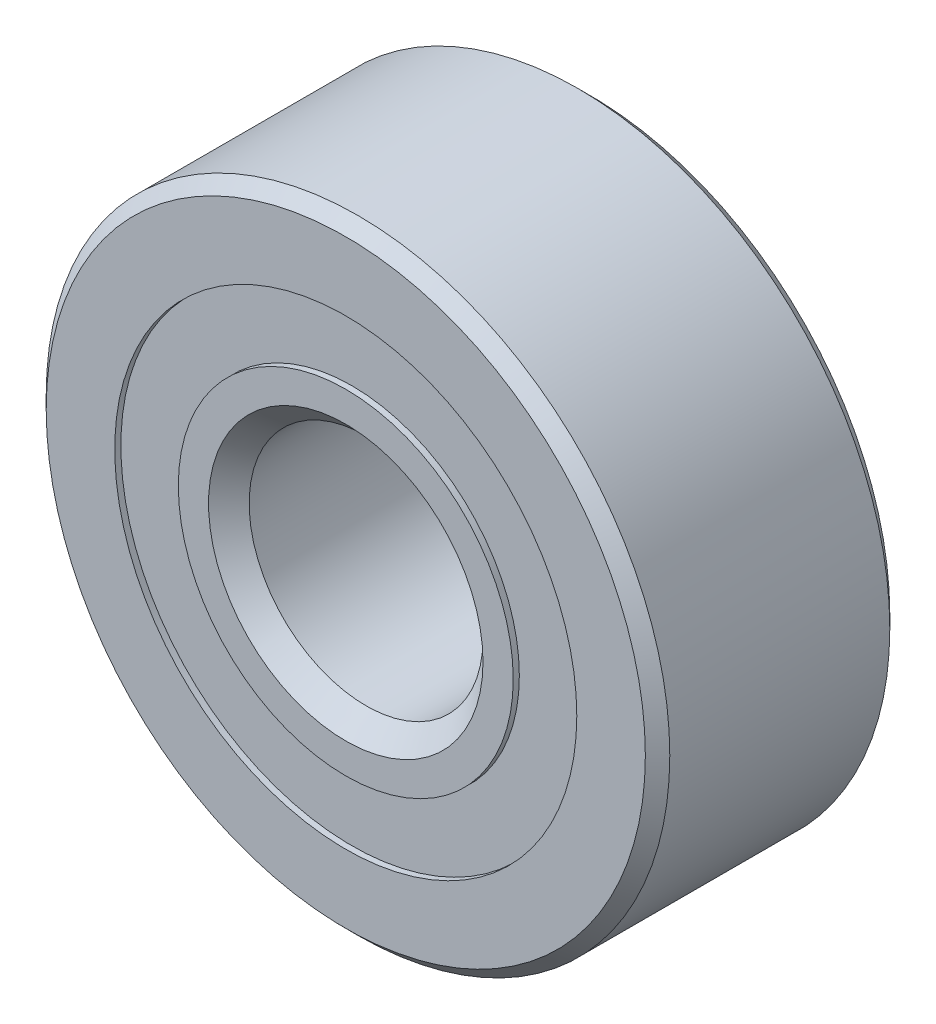
ISO-10303-21;
HEADER;
FILE_DESCRIPTION(('STEP AP214'),'2;1');
FILE_NAME('part.step','',(''),(''),'','','');
FILE_SCHEMA(('AUTOMOTIVE_DESIGN { 1 0 10303 214 1 1 1 1 }'));
ENDSEC;
DATA;
#1=APPLICATION_CONTEXT('core data for automotive mechanical design processes');
#2=APPLICATION_PROTOCOL_DEFINITION('international standard','automotive_design',2000,#1);
#3=PRODUCT_CONTEXT('',#1,'mechanical');
#4=PRODUCT('Part','Part','',(#3));
#5=PRODUCT_RELATED_PRODUCT_CATEGORY('part','',(#4));
#6=PRODUCT_DEFINITION_FORMATION('','',#4);
#7=PRODUCT_DEFINITION_CONTEXT('part definition',#1,'design');
#8=PRODUCT_DEFINITION('design','',#6,#7);
#9=PRODUCT_DEFINITION_SHAPE('','',#8);
#10=(LENGTH_UNIT() NAMED_UNIT(*) SI_UNIT(.MILLI.,.METRE.));
#11=(NAMED_UNIT(*) PLANE_ANGLE_UNIT() SI_UNIT($,.RADIAN.));
#12=(NAMED_UNIT(*) SI_UNIT($,.STERADIAN.) SOLID_ANGLE_UNIT());
#13=UNCERTAINTY_MEASURE_WITH_UNIT(LENGTH_MEASURE(1.E-05),#10,'distance_accuracy_value','');
#14=(GEOMETRIC_REPRESENTATION_CONTEXT(3) GLOBAL_UNCERTAINTY_ASSIGNED_CONTEXT((#13)) GLOBAL_UNIT_ASSIGNED_CONTEXT((#10,
#11,#12)) REPRESENTATION_CONTEXT('',''));
#15=CARTESIAN_POINT('',(0.,0.,0.));
#16=DIRECTION('',(0.,0.,1.));
#17=DIRECTION('',(1.,0.,0.));
#18=AXIS2_PLACEMENT_3D('',#15,#16,#17);
#19=CARTESIAN_POINT('',(0.,4.70503598901099,-2.36474));
#20=DIRECTION('',(0.,0.,1.));
#21=DIRECTION('',(1.,0.,0.));
#22=AXIS2_PLACEMENT_3D('',#19,#20,#21);
#23=PLANE('',#22);
#24=CARTESIAN_POINT('',(0.,0.,-2.36474));
#25=DIRECTION('',(0.,0.,1.));
#26=DIRECTION('',(1.,0.,0.));
#27=AXIS2_PLACEMENT_3D('',#24,#25,#26);
#28=CIRCLE('',#27,4.70503598901099);
#29=CARTESIAN_POINT('',(4.70503598901099,0.,-2.36474));
#30=VERTEX_POINT('',#29);
#31=EDGE_CURVE('E55',#30,#30,#28,.T.);
#32=ORIENTED_EDGE('',*,*,#31,.F.);
#33=EDGE_LOOP('',(#32));
#34=FACE_BOUND('',#33,.T.);
#35=CARTESIAN_POINT('',(0.,0.,-2.36474));
#36=DIRECTION('',(0.,0.,1.));
#37=DIRECTION('',(1.,0.,0.));
#38=AXIS2_PLACEMENT_3D('',#35,#36,#37);
#39=CIRCLE('',#38,3.41052443182517);
#40=CARTESIAN_POINT('',(3.41052443182517,0.,-2.36474));
#41=VERTEX_POINT('',#40);
#42=EDGE_CURVE('E11',#41,#41,#39,.T.);
#43=ORIENTED_EDGE('',*,*,#42,.T.);
#44=EDGE_LOOP('',(#43));
#45=FACE_BOUND('',#44,.T.);
#46=ADVANCED_FACE('F41',(#34,#45),#23,.F.);
#47=CARTESIAN_POINT('',(0.,0.,2.4892));
#48=DIRECTION('',(0.,0.,1.));
#49=DIRECTION('',(1.,0.,0.));
#50=AXIS2_PLACEMENT_3D('',#47,#48,#49);
#51=CYLINDRICAL_SURFACE('',#50,3.41052443182517);
#52=ORIENTED_EDGE('',*,*,#42,.F.);
#53=EDGE_LOOP('',(#52));
#54=FACE_BOUND('',#53,.T.);
#55=CARTESIAN_POINT('',(0.,0.,-1.15720529467736));
#56=DIRECTION('',(0.,0.,1.));
#57=DIRECTION('',(1.,0.,0.));
#58=AXIS2_PLACEMENT_3D('',#55,#56,#57);
#59=CIRCLE('',#58,3.41052443182517);
#60=CARTESIAN_POINT('',(3.41052443182517,0.,-1.15720529467736));
#61=VERTEX_POINT('',#60);
#62=EDGE_CURVE('E47',#61,#61,#59,.T.);
#63=ORIENTED_EDGE('',*,*,#62,.T.);
#64=EDGE_LOOP('',(#63));
#65=FACE_BOUND('',#64,.T.);
#66=ADVANCED_FACE('F64',(#54,#65),#51,.F.);
#67=CARTESIAN_POINT('',(0.,4.70503598901099,-1.15720529467736));
#68=DIRECTION('',(0.,0.,-1.));
#69=DIRECTION('',(-1.,0.,0.));
#70=AXIS2_PLACEMENT_3D('',#67,#68,#69);
#71=PLANE('',#70);
#72=ORIENTED_EDGE('',*,*,#62,.F.);
#73=EDGE_LOOP('',(#72));
#74=FACE_BOUND('',#73,.T.);
#75=CARTESIAN_POINT('',(0.,0.,-1.15720529467736));
#76=DIRECTION('',(0.,0.,1.));
#77=DIRECTION('',(1.,0.,0.));
#78=AXIS2_PLACEMENT_3D('',#75,#76,#77);
#79=CIRCLE('',#78,4.70503598901099);
#80=CARTESIAN_POINT('',(4.70503598901099,0.,-1.15720529467736));
#81=VERTEX_POINT('',#80);
#82=EDGE_CURVE('E51',#81,#81,#79,.T.);
#83=ORIENTED_EDGE('',*,*,#82,.T.);
#84=EDGE_LOOP('',(#83));
#85=FACE_BOUND('',#84,.T.);
#86=ADVANCED_FACE('F68',(#74,#85),#71,.F.);
#87=CARTESIAN_POINT('',(0.,0.,2.4892));
#88=DIRECTION('',(0.,0.,1.));
#89=DIRECTION('',(1.,0.,0.));
#90=AXIS2_PLACEMENT_3D('',#87,#88,#89);
#91=CYLINDRICAL_SURFACE('',#90,4.70503598901099);
#92=ORIENTED_EDGE('',*,*,#82,.F.);
#93=EDGE_LOOP('',(#92));
#94=FACE_BOUND('',#93,.T.);
#95=ORIENTED_EDGE('',*,*,#31,.T.);
#96=EDGE_LOOP('',(#95));
#97=FACE_BOUND('',#96,.T.);
#98=ADVANCED_FACE('F61',(#94,#97),#91,.T.);
#99=CLOSED_SHELL('',(#46,#66,#86,#98));
#100=MANIFOLD_SOLID_BREP('B2',#99);
#101=CARTESIAN_POINT('',(0.,4.70503598901099,2.36474));
#102=DIRECTION('',(0.,0.,-1.));
#103=DIRECTION('',(-1.,0.,0.));
#104=AXIS2_PLACEMENT_3D('',#101,#102,#103);
#105=PLANE('',#104);
#106=CARTESIAN_POINT('',(0.,0.,2.36474));
#107=DIRECTION('',(0.,0.,1.));
#108=DIRECTION('',(1.,0.,0.));
#109=AXIS2_PLACEMENT_3D('',#106,#107,#108);
#110=CIRCLE('',#109,3.41052443182517);
#111=CARTESIAN_POINT('',(3.41052443182517,0.,2.36474));
#112=VERTEX_POINT('',#111);
#113=EDGE_CURVE('E40',#112,#112,#110,.T.);
#114=ORIENTED_EDGE('',*,*,#113,.F.);
#115=EDGE_LOOP('',(#114));
#116=FACE_BOUND('',#115,.T.);
#117=CARTESIAN_POINT('',(0.,0.,2.36474));
#118=DIRECTION('',(0.,0.,1.));
#119=DIRECTION('',(1.,0.,0.));
#120=AXIS2_PLACEMENT_3D('',#117,#118,#119);
#121=CIRCLE('',#120,4.70503598901099);
#122=CARTESIAN_POINT('',(4.70503598901099,0.,2.36474));
#123=VERTEX_POINT('',#122);
#124=EDGE_CURVE('E122',#123,#123,#121,.T.);
#125=ORIENTED_EDGE('',*,*,#124,.T.);
#126=EDGE_LOOP('',(#125));
#127=FACE_BOUND('',#126,.T.);
#128=ADVANCED_FACE('F108',(#116,#127),#105,.F.);
#129=CARTESIAN_POINT('',(0.,0.,2.4892));
#130=DIRECTION('',(0.,0.,1.));
#131=DIRECTION('',(1.,0.,0.));
#132=AXIS2_PLACEMENT_3D('',#129,#130,#131);
#133=CYLINDRICAL_SURFACE('',#132,3.41052443182517);
#134=CARTESIAN_POINT('',(0.,0.,1.15720529467736));
#135=DIRECTION('',(0.,0.,1.));
#136=DIRECTION('',(1.,0.,0.));
#137=AXIS2_PLACEMENT_3D('',#134,#135,#136);
#138=CIRCLE('',#137,3.41052443182517);
#139=CARTESIAN_POINT('',(3.41052443182517,0.,1.15720529467736));
#140=VERTEX_POINT('',#139);
#141=EDGE_CURVE('E114',#140,#140,#138,.T.);
#142=ORIENTED_EDGE('',*,*,#141,.F.);
#143=EDGE_LOOP('',(#142));
#144=FACE_BOUND('',#143,.T.);
#145=ORIENTED_EDGE('',*,*,#113,.T.);
#146=EDGE_LOOP('',(#145));
#147=FACE_BOUND('',#146,.T.);
#148=ADVANCED_FACE('F137',(#144,#147),#133,.F.);
#149=CARTESIAN_POINT('',(0.,4.70503598901099,1.15720529467736));
#150=DIRECTION('',(0.,0.,1.));
#151=DIRECTION('',(1.,0.,0.));
#152=AXIS2_PLACEMENT_3D('',#149,#150,#151);
#153=PLANE('',#152);
#154=CARTESIAN_POINT('',(0.,0.,1.15720529467736));
#155=DIRECTION('',(0.,0.,1.));
#156=DIRECTION('',(1.,0.,0.));
#157=AXIS2_PLACEMENT_3D('',#154,#155,#156);
#158=CIRCLE('',#157,4.70503598901099);
#159=CARTESIAN_POINT('',(4.70503598901099,0.,1.15720529467736));
#160=VERTEX_POINT('',#159);
#161=EDGE_CURVE('E118',#160,#160,#158,.T.);
#162=ORIENTED_EDGE('',*,*,#161,.F.);
#163=EDGE_LOOP('',(#162));
#164=FACE_BOUND('',#163,.T.);
#165=ORIENTED_EDGE('',*,*,#141,.T.);
#166=EDGE_LOOP('',(#165));
#167=FACE_BOUND('',#166,.T.);
#168=ADVANCED_FACE('F132',(#164,#167),#153,.F.);
#169=CARTESIAN_POINT('',(0.,0.,2.4892));
#170=DIRECTION('',(0.,0.,1.));
#171=DIRECTION('',(1.,0.,0.));
#172=AXIS2_PLACEMENT_3D('',#169,#170,#171);
#173=CYLINDRICAL_SURFACE('',#172,4.70503598901099);
#174=ORIENTED_EDGE('',*,*,#124,.F.);
#175=EDGE_LOOP('',(#174));
#176=FACE_BOUND('',#175,.T.);
#177=ORIENTED_EDGE('',*,*,#161,.T.);
#178=EDGE_LOOP('',(#177));
#179=FACE_BOUND('',#178,.T.);
#180=ADVANCED_FACE('F129',(#176,#179),#173,.T.);
#181=CLOSED_SHELL('',(#128,#148,#168,#180));
#182=MANIFOLD_SOLID_BREP('B6',#181);
#183=CARTESIAN_POINT('',(-3.08696304161748,3.08696304161756,0.));
#184=DIRECTION('',(0.,0.,1.));
#185=DIRECTION('',(-0.707106781186539,0.707106781186556,0.));
#186=AXIS2_PLACEMENT_3D('',#183,#184,#185);
#187=SPHERICAL_SURFACE('',#186,1.15720529467736);
#188=CARTESIAN_POINT('',(-3.08696304161748,3.08696304161756,1.15720529467736));
#189=VERTEX_POINT('',#188);
#190=VERTEX_LOOP('',#189);
#191=FACE_BOUND('',#190,.T.);
#192=ADVANCED_FACE('F188',(#191),#187,.T.);
#193=CLOSED_SHELL('',(#192));
#194=MANIFOLD_SOLID_BREP('B35',#193);
#195=CARTESIAN_POINT('',(-4.365625,0.,0.));
#196=DIRECTION('',(0.,0.,1.));
#197=DIRECTION('',(-1.,0.,0.));
#198=AXIS2_PLACEMENT_3D('',#195,#196,#197);
#199=SPHERICAL_SURFACE('',#198,1.15720529467736);
#200=CARTESIAN_POINT('',(-4.365625,0.,1.15720529467736));
#201=VERTEX_POINT('',#200);
#202=VERTEX_LOOP('',#201);
#203=FACE_BOUND('',#202,.T.);
#204=ADVANCED_FACE('F219',(#203),#199,.T.);
#205=CLOSED_SHELL('',(#204));
#206=MANIFOLD_SOLID_BREP('B104',#205);
#207=CARTESIAN_POINT('',(-3.08696304161755,-3.08696304161749,0.));
#208=DIRECTION('',(0.,0.,1.));
#209=DIRECTION('',(-0.707106781186554,-0.707106781186541,0.));
#210=AXIS2_PLACEMENT_3D('',#207,#208,#209);
#211=SPHERICAL_SURFACE('',#210,1.15720529467736);
#212=CARTESIAN_POINT('',(-3.08696304161755,-3.08696304161749,1.15720529467736));
#213=VERTEX_POINT('',#212);
#214=VERTEX_LOOP('',#213);
#215=FACE_BOUND('',#214,.T.);
#216=ADVANCED_FACE('F250',(#215),#211,.T.);
#217=CLOSED_SHELL('',(#216));
#218=MANIFOLD_SOLID_BREP('B184',#217);
#219=CARTESIAN_POINT('',(0.,-4.365625,0.));
#220=DIRECTION('',(0.,0.,1.));
#221=DIRECTION('',(0.,-1.,0.));
#222=AXIS2_PLACEMENT_3D('',#219,#220,#221);
#223=SPHERICAL_SURFACE('',#222,1.15720529467736);
#224=CARTESIAN_POINT('',(0.,-4.365625,1.15720529467736));
#225=VERTEX_POINT('',#224);
#226=VERTEX_LOOP('',#225);
#227=FACE_BOUND('',#226,.T.);
#228=ADVANCED_FACE('F281',(#227),#223,.T.);
#229=CLOSED_SHELL('',(#228));
#230=MANIFOLD_SOLID_BREP('B215',#229);
#231=CARTESIAN_POINT('',(3.0869630416175,-3.08696304161754,0.));
#232=DIRECTION('',(0.,0.,1.));
#233=DIRECTION('',(0.707106781186544,-0.707106781186551,0.));
#234=AXIS2_PLACEMENT_3D('',#231,#232,#233);
#235=SPHERICAL_SURFACE('',#234,1.15720529467736);
#236=CARTESIAN_POINT('',(3.0869630416175,-3.08696304161754,1.15720529467736));
#237=VERTEX_POINT('',#236);
#238=VERTEX_LOOP('',#237);
#239=FACE_BOUND('',#238,.T.);
#240=ADVANCED_FACE('F312',(#239),#235,.T.);
#241=CLOSED_SHELL('',(#240));
#242=MANIFOLD_SOLID_BREP('B246',#241);
#243=CARTESIAN_POINT('',(4.365625,0.,0.));
#244=DIRECTION('',(0.,0.,1.));
#245=DIRECTION('',(1.,0.,0.));
#246=AXIS2_PLACEMENT_3D('',#243,#244,#245);
#247=SPHERICAL_SURFACE('',#246,1.15720529467736);
#248=CARTESIAN_POINT('',(4.365625,0.,1.15720529467736));
#249=VERTEX_POINT('',#248);
#250=VERTEX_LOOP('',#249);
#251=FACE_BOUND('',#250,.T.);
#252=ADVANCED_FACE('F343',(#251),#247,.T.);
#253=CLOSED_SHELL('',(#252));
#254=MANIFOLD_SOLID_BREP('B277',#253);
#255=CARTESIAN_POINT('',(3.08696304161753,3.08696304161752,0.));
#256=DIRECTION('',(0.,0.,1.));
#257=DIRECTION('',(0.707106781186549,0.707106781186546,0.));
#258=AXIS2_PLACEMENT_3D('',#255,#256,#257);
#259=SPHERICAL_SURFACE('',#258,1.15720529467736);
#260=CARTESIAN_POINT('',(3.08696304161753,3.08696304161752,1.15720529467736));
#261=VERTEX_POINT('',#260);
#262=VERTEX_LOOP('',#261);
#263=FACE_BOUND('',#262,.T.);
#264=ADVANCED_FACE('F374',(#263),#259,.T.);
#265=CLOSED_SHELL('',(#264));
#266=MANIFOLD_SOLID_BREP('B308',#265);
#267=CARTESIAN_POINT('',(0.,4.365625,0.));
#268=DIRECTION('',(0.,0.,1.));
#269=DIRECTION('',(0.,1.,0.));
#270=AXIS2_PLACEMENT_3D('',#267,#268,#269);
#271=SPHERICAL_SURFACE('',#270,1.15720529467736);
#272=CARTESIAN_POINT('',(0.,4.365625,1.15720529467736));
#273=VERTEX_POINT('',#272);
#274=VERTEX_LOOP('',#273);
#275=FACE_BOUND('',#274,.T.);
#276=ADVANCED_FACE('F407',(#275),#271,.T.);
#277=CLOSED_SHELL('',(#276));
#278=MANIFOLD_SOLID_BREP('B339',#277);
#279=CARTESIAN_POINT('',(0.,0.,2.4892));
#280=DIRECTION('',(0.,0.,1.));
#281=DIRECTION('',(1.,0.,0.));
#282=AXIS2_PLACEMENT_3D('',#279,#280,#281);
#283=CYLINDRICAL_SURFACE('',#282,3.41052443182517);
#284=CARTESIAN_POINT('',(0.,0.,2.4892));
#285=DIRECTION('',(0.,0.,1.));
#286=DIRECTION('',(1.,0.,0.));
#287=AXIS2_PLACEMENT_3D('',#284,#285,#286);
#288=CIRCLE('',#287,3.41052443182517);
#289=CARTESIAN_POINT('',(3.41052443182517,0.,2.4892));
#290=VERTEX_POINT('',#289);
#291=EDGE_CURVE('E466',#290,#290,#288,.T.);
#292=ORIENTED_EDGE('',*,*,#291,.F.);
#293=EDGE_LOOP('',(#292));
#294=FACE_BOUND('',#293,.T.);
#295=CARTESIAN_POINT('',(0.,0.,2.36474));
#296=DIRECTION('',(0.,0.,1.));
#297=DIRECTION('',(1.,0.,0.));
#298=AXIS2_PLACEMENT_3D('',#295,#296,#297);
#299=CIRCLE('',#298,3.41052443182517);
#300=CARTESIAN_POINT('',(3.41052443182517,0.,2.36474));
#301=VERTEX_POINT('',#300);
#302=EDGE_CURVE('E406',#301,#301,#299,.T.);
#303=ORIENTED_EDGE('',*,*,#302,.T.);
#304=EDGE_LOOP('',(#303));
#305=FACE_BOUND('',#304,.T.);
#306=ADVANCED_FACE('F426',(#294,#305),#283,.T.);
#307=CARTESIAN_POINT('',(0.,3.41052443182517,2.36474));
#308=DIRECTION('',(0.,0.,1.));
#309=DIRECTION('',(1.,0.,0.));
#310=AXIS2_PLACEMENT_3D('',#307,#308,#309);
#311=PLANE('',#310);
#312=ORIENTED_EDGE('',*,*,#302,.F.);
#313=EDGE_LOOP('',(#312));
#314=FACE_BOUND('',#313,.T.);
#315=CARTESIAN_POINT('',(0.,0.,2.36474));
#316=DIRECTION('',(0.,0.,1.));
#317=DIRECTION('',(1.,0.,0.));
#318=AXIS2_PLACEMENT_3D('',#315,#316,#317);
#319=CIRCLE('',#318,3.28606443182517);
#320=CARTESIAN_POINT('',(3.28606443182517,0.,2.36474));
#321=VERTEX_POINT('',#320);
#322=EDGE_CURVE('E432',#321,#321,#319,.T.);
#323=ORIENTED_EDGE('',*,*,#322,.T.);
#324=EDGE_LOOP('',(#323));
#325=FACE_BOUND('',#324,.T.);
#326=ADVANCED_FACE('F473',(#314,#325),#311,.F.);
#327=CARTESIAN_POINT('',(0.,0.,1.87351042083616));
#328=DIRECTION('',(0.,0.,1.));
#329=DIRECTION('',(1.,0.,0.));
#330=AXIS2_PLACEMENT_3D('',#327,#328,#329);
#331=CONICAL_SURFACE('',#330,2.79483485266132,0.78539816339745);
#332=ORIENTED_EDGE('',*,*,#322,.F.);
#333=EDGE_LOOP('',(#332));
#334=FACE_BOUND('',#333,.T.);
#335=CARTESIAN_POINT('',(0.,0.,1.87351042083616));
#336=DIRECTION('',(0.,0.,1.));
#337=DIRECTION('',(1.,0.,0.));
#338=AXIS2_PLACEMENT_3D('',#335,#336,#337);
#339=CIRCLE('',#338,2.79483485266132);
#340=CARTESIAN_POINT('',(2.79483485266132,0.,1.87351042083616));
#341=VERTEX_POINT('',#340);
#342=EDGE_CURVE('E436',#341,#341,#339,.T.);
#343=ORIENTED_EDGE('',*,*,#342,.T.);
#344=EDGE_LOOP('',(#343));
#345=FACE_BOUND('',#344,.T.);
#346=ADVANCED_FACE('F477',(#334,#345),#331,.T.);
#347=CARTESIAN_POINT('',(0.,0.,2.4892));
#348=DIRECTION('',(0.,0.,1.));
#349=DIRECTION('',(1.,0.,0.));
#350=AXIS2_PLACEMENT_3D('',#347,#348,#349);
#351=CYLINDRICAL_SURFACE('',#350,2.79483485266132);
#352=ORIENTED_EDGE('',*,*,#342,.F.);
#353=EDGE_LOOP('',(#352));
#354=FACE_BOUND('',#353,.T.);
#355=CARTESIAN_POINT('',(0.,0.,0.));
#356=DIRECTION('',(0.,0.,1.));
#357=DIRECTION('',(1.,0.,0.));
#358=AXIS2_PLACEMENT_3D('',#355,#356,#357);
#359=CIRCLE('',#358,2.79483485266132);
#360=CARTESIAN_POINT('',(2.79483485266132,0.,0.));
#361=VERTEX_POINT('',#360);
#362=EDGE_CURVE('E440',#361,#361,#359,.T.);
#363=ORIENTED_EDGE('',*,*,#362,.T.);
#364=EDGE_LOOP('',(#363));
#365=FACE_BOUND('',#364,.T.);
#366=ADVANCED_FACE('F482',(#354,#365),#351,.T.);
#367=CARTESIAN_POINT('',(0.,2.79483485266132,0.));
#368=DIRECTION('',(0.,0.,-1.));
#369=DIRECTION('',(-1.,0.,0.));
#370=AXIS2_PLACEMENT_3D('',#367,#368,#369);
#371=PLANE('',#370);
#372=ORIENTED_EDGE('',*,*,#362,.F.);
#373=EDGE_LOOP('',(#372));
#374=FACE_BOUND('',#373,.T.);
#375=CARTESIAN_POINT('',(0.,0.,0.));
#376=DIRECTION('',(0.,0.,1.));
#377=DIRECTION('',(1.,0.,0.));
#378=AXIS2_PLACEMENT_3D('',#375,#376,#377);
#379=CIRCLE('',#378,3.20841970532264);
#380=CARTESIAN_POINT('',(3.20841970532264,0.,0.));
#381=VERTEX_POINT('',#380);
#382=EDGE_CURVE('E445',#381,#381,#379,.T.);
#383=ORIENTED_EDGE('',*,*,#382,.T.);
#384=EDGE_LOOP('',(#383));
#385=FACE_BOUND('',#384,.T.);
#386=ADVANCED_FACE('F488',(#374,#385),#371,.F.);
#387=CARTESIAN_POINT('',(0.,0.,0.));
#388=DIRECTION('',(0.,0.,1.));
#389=DIRECTION('',(1.,0.,0.));
#390=AXIS2_PLACEMENT_3D('',#387,#388,#389);
#391=TOROIDAL_SURFACE('',#390,4.365625,1.15720529467736);
#392=ORIENTED_EDGE('',*,*,#382,.F.);
#393=EDGE_LOOP('',(#392));
#394=FACE_BOUND('',#393,.T.);
#395=CARTESIAN_POINT('',(0.,0.,-1.10631111111111));
#396=DIRECTION('',(0.,0.,1.));
#397=DIRECTION('',(1.,0.,0.));
#398=AXIS2_PLACEMENT_3D('',#395,#396,#397);
#399=CIRCLE('',#398,4.02621401098901);
#400=CARTESIAN_POINT('',(4.02621401098901,0.,-1.10631111111111));
#401=VERTEX_POINT('',#400);
#402=EDGE_CURVE('E448',#401,#401,#399,.T.);
#403=ORIENTED_EDGE('',*,*,#402,.T.);
#404=EDGE_LOOP('',(#403));
#405=FACE_BOUND('',#404,.T.);
#406=ADVANCED_FACE('F492',(#394,#405),#391,.F.);
#407=CARTESIAN_POINT('',(0.,0.,2.4892));
#408=DIRECTION('',(0.,0.,1.));
#409=DIRECTION('',(1.,0.,0.));
#410=AXIS2_PLACEMENT_3D('',#407,#408,#409);
#411=CYLINDRICAL_SURFACE('',#410,4.02621401098901);
#412=ORIENTED_EDGE('',*,*,#402,.F.);
#413=EDGE_LOOP('',(#412));
#414=FACE_BOUND('',#413,.T.);
#415=CARTESIAN_POINT('',(0.,0.,-2.4892));
#416=DIRECTION('',(0.,0.,1.));
#417=DIRECTION('',(1.,0.,0.));
#418=AXIS2_PLACEMENT_3D('',#415,#416,#417);
#419=CIRCLE('',#418,4.02621401098901);
#420=CARTESIAN_POINT('',(4.02621401098901,0.,-2.4892));
#421=VERTEX_POINT('',#420);
#422=EDGE_CURVE('E451',#421,#421,#419,.T.);
#423=ORIENTED_EDGE('',*,*,#422,.T.);
#424=EDGE_LOOP('',(#423));
#425=FACE_BOUND('',#424,.T.);
#426=ADVANCED_FACE('F496',(#414,#425),#411,.T.);
#427=CARTESIAN_POINT('',(0.,2.63017,-2.4892));
#428=DIRECTION('',(0.,0.,1.));
#429=DIRECTION('',(1.,0.,0.));
#430=AXIS2_PLACEMENT_3D('',#427,#428,#429);
#431=PLANE('',#430);
#432=ORIENTED_EDGE('',*,*,#422,.F.);
#433=EDGE_LOOP('',(#432));
#434=FACE_BOUND('',#433,.T.);
#435=CARTESIAN_POINT('',(0.,0.,-2.4892));
#436=DIRECTION('',(0.,0.,1.));
#437=DIRECTION('',(1.,0.,0.));
#438=AXIS2_PLACEMENT_3D('',#435,#436,#437);
#439=CIRCLE('',#438,2.63017);
#440=CARTESIAN_POINT('',(2.63017,0.,-2.4892));
#441=VERTEX_POINT('',#440);
#442=EDGE_CURVE('E454',#441,#441,#439,.T.);
#443=ORIENTED_EDGE('',*,*,#442,.T.);
#444=EDGE_LOOP('',(#443));
#445=FACE_BOUND('',#444,.T.);
#446=ADVANCED_FACE('F500',(#434,#445),#431,.F.);
#447=CARTESIAN_POINT('',(0.,0.,-2.24028));
#448=DIRECTION('',(0.,0.,-1.));
#449=DIRECTION('',(-1.,0.,0.));
#450=AXIS2_PLACEMENT_3D('',#447,#448,#449);
#451=CONICAL_SURFACE('',#450,2.38125,0.785398163397447);
#452=ORIENTED_EDGE('',*,*,#442,.F.);
#453=EDGE_LOOP('',(#452));
#454=FACE_BOUND('',#453,.T.);
#455=CARTESIAN_POINT('',(0.,0.,-2.24028));
#456=DIRECTION('',(0.,0.,1.));
#457=DIRECTION('',(1.,0.,0.));
#458=AXIS2_PLACEMENT_3D('',#455,#456,#457);
#459=CIRCLE('',#458,2.38125);
#460=CARTESIAN_POINT('',(2.38125,0.,-2.24028));
#461=VERTEX_POINT('',#460);
#462=EDGE_CURVE('E457',#461,#461,#459,.T.);
#463=ORIENTED_EDGE('',*,*,#462,.T.);
#464=EDGE_LOOP('',(#463));
#465=FACE_BOUND('',#464,.T.);
#466=ADVANCED_FACE('F504',(#454,#465),#451,.F.);
#467=CARTESIAN_POINT('',(0.,0.,2.4892));
#468=DIRECTION('',(0.,0.,1.));
#469=DIRECTION('',(1.,0.,0.));
#470=AXIS2_PLACEMENT_3D('',#467,#468,#469);
#471=CYLINDRICAL_SURFACE('',#470,2.38125);
#472=ORIENTED_EDGE('',*,*,#462,.F.);
#473=EDGE_LOOP('',(#472));
#474=FACE_BOUND('',#473,.T.);
#475=CARTESIAN_POINT('',(0.,0.,2.07561514733868));
#476=DIRECTION('',(0.,0.,1.));
#477=DIRECTION('',(1.,0.,0.));
#478=AXIS2_PLACEMENT_3D('',#475,#476,#477);
#479=CIRCLE('',#478,2.38125);
#480=CARTESIAN_POINT('',(2.38125,0.,2.07561514733868));
#481=VERTEX_POINT('',#480);
#482=EDGE_CURVE('E460',#481,#481,#479,.T.);
#483=ORIENTED_EDGE('',*,*,#482,.T.);
#484=EDGE_LOOP('',(#483));
#485=FACE_BOUND('',#484,.T.);
#486=ADVANCED_FACE('F508',(#474,#485),#471,.F.);
#487=CARTESIAN_POINT('',(0.,0.,2.4892));
#488=DIRECTION('',(0.,0.,1.));
#489=DIRECTION('',(1.,0.,0.));
#490=AXIS2_PLACEMENT_3D('',#487,#488,#489);
#491=CONICAL_SURFACE('',#490,2.79483485266132,0.78539816339745);
#492=ORIENTED_EDGE('',*,*,#482,.F.);
#493=EDGE_LOOP('',(#492));
#494=FACE_BOUND('',#493,.T.);
#495=CARTESIAN_POINT('',(0.,0.,2.4892));
#496=DIRECTION('',(0.,0.,1.));
#497=DIRECTION('',(1.,0.,0.));
#498=AXIS2_PLACEMENT_3D('',#495,#496,#497);
#499=CIRCLE('',#498,2.79483485266132);
#500=CARTESIAN_POINT('',(2.79483485266132,0.,2.4892));
#501=VERTEX_POINT('',#500);
#502=EDGE_CURVE('E463',#501,#501,#499,.T.);
#503=ORIENTED_EDGE('',*,*,#502,.T.);
#504=EDGE_LOOP('',(#503));
#505=FACE_BOUND('',#504,.T.);
#506=ADVANCED_FACE('F512',(#494,#505),#491,.F.);
#507=CARTESIAN_POINT('',(0.,3.41052443182517,2.4892));
#508=DIRECTION('',(0.,0.,-1.));
#509=DIRECTION('',(-1.,0.,0.));
#510=AXIS2_PLACEMENT_3D('',#507,#508,#509);
#511=PLANE('',#510);
#512=ORIENTED_EDGE('',*,*,#502,.F.);
#513=EDGE_LOOP('',(#512));
#514=FACE_BOUND('',#513,.T.);
#515=ORIENTED_EDGE('',*,*,#291,.T.);
#516=EDGE_LOOP('',(#515));
#517=FACE_BOUND('',#516,.T.);
#518=ADVANCED_FACE('F470',(#514,#517),#511,.F.);
#519=CLOSED_SHELL('',(#306,#326,#346,#366,#386,#406,#426,#446,#466,#486,#506,#518));
#520=MANIFOLD_SOLID_BREP('B370',#519);
#521=CARTESIAN_POINT('',(0.,0.,2.24028));
#522=DIRECTION('',(0.,0.,-1.));
#523=DIRECTION('',(-1.,0.,0.));
#524=AXIS2_PLACEMENT_3D('',#521,#522,#523);
#525=CONICAL_SURFACE('',#524,6.35,0.78539816339745);
#526=CARTESIAN_POINT('',(0.,0.,2.4892));
#527=DIRECTION('',(0.,0.,1.));
#528=DIRECTION('',(1.,0.,0.));
#529=AXIS2_PLACEMENT_3D('',#526,#527,#528);
#530=CIRCLE('',#529,6.10108);
#531=CARTESIAN_POINT('',(6.10108,0.,2.4892));
#532=VERTEX_POINT('',#531);
#533=EDGE_CURVE('E635',#532,#532,#530,.T.);
#534=ORIENTED_EDGE('',*,*,#533,.F.);
#535=EDGE_LOOP('',(#534));
#536=FACE_BOUND('',#535,.T.);
#537=CARTESIAN_POINT('',(0.,0.,2.24028));
#538=DIRECTION('',(0.,0.,1.));
#539=DIRECTION('',(1.,0.,0.));
#540=AXIS2_PLACEMENT_3D('',#537,#538,#539);
#541=CIRCLE('',#540,6.35);
#542=CARTESIAN_POINT('',(6.35,0.,2.24028));
#543=VERTEX_POINT('',#542);
#544=EDGE_CURVE('E425',#543,#543,#541,.T.);
#545=ORIENTED_EDGE('',*,*,#544,.T.);
#546=EDGE_LOOP('',(#545));
#547=FACE_BOUND('',#546,.T.);
#548=ADVANCED_FACE('F607',(#536,#547),#525,.T.);
#549=CARTESIAN_POINT('',(0.,0.,2.4892));
#550=DIRECTION('',(0.,0.,1.));
#551=DIRECTION('',(1.,0.,0.));
#552=AXIS2_PLACEMENT_3D('',#549,#550,#551);
#553=CYLINDRICAL_SURFACE('',#552,6.35);
#554=ORIENTED_EDGE('',*,*,#544,.F.);
#555=EDGE_LOOP('',(#554));
#556=FACE_BOUND('',#555,.T.);
#557=CARTESIAN_POINT('',(0.,0.,-2.24028));
#558=DIRECTION('',(0.,0.,1.));
#559=DIRECTION('',(1.,0.,0.));
#560=AXIS2_PLACEMENT_3D('',#557,#558,#559);
#561=CIRCLE('',#560,6.35);
#562=CARTESIAN_POINT('',(6.35,0.,-2.24028));
#563=VERTEX_POINT('',#562);
#564=EDGE_CURVE('E613',#563,#563,#561,.T.);
#565=ORIENTED_EDGE('',*,*,#564,.T.);
#566=EDGE_LOOP('',(#565));
#567=FACE_BOUND('',#566,.T.);
#568=ADVANCED_FACE('F642',(#556,#567),#553,.T.);
#569=CARTESIAN_POINT('',(0.,0.,-2.4892));
#570=DIRECTION('',(0.,0.,1.));
#571=DIRECTION('',(1.,0.,0.));
#572=AXIS2_PLACEMENT_3D('',#569,#570,#571);
#573=CONICAL_SURFACE('',#572,6.10108,0.78539816339745);
#574=ORIENTED_EDGE('',*,*,#564,.F.);
#575=EDGE_LOOP('',(#574));
#576=FACE_BOUND('',#575,.T.);
#577=CARTESIAN_POINT('',(0.,0.,-2.4892));
#578=DIRECTION('',(0.,0.,1.));
#579=DIRECTION('',(1.,0.,0.));
#580=AXIS2_PLACEMENT_3D('',#577,#578,#579);
#581=CIRCLE('',#580,6.10108);
#582=CARTESIAN_POINT('',(6.10108,0.,-2.4892));
#583=VERTEX_POINT('',#582);
#584=EDGE_CURVE('E617',#583,#583,#581,.T.);
#585=ORIENTED_EDGE('',*,*,#584,.T.);
#586=EDGE_LOOP('',(#585));
#587=FACE_BOUND('',#586,.T.);
#588=ADVANCED_FACE('F646',(#576,#587),#573,.T.);
#589=CARTESIAN_POINT('',(0.,6.10108,-2.4892));
#590=DIRECTION('',(0.,0.,1.));
#591=DIRECTION('',(1.,0.,0.));
#592=AXIS2_PLACEMENT_3D('',#589,#590,#591);
#593=PLANE('',#592);
#594=ORIENTED_EDGE('',*,*,#584,.F.);
#595=EDGE_LOOP('',(#594));
#596=FACE_BOUND('',#595,.T.);
#597=CARTESIAN_POINT('',(0.,0.,-2.4892));
#598=DIRECTION('',(0.,0.,1.));
#599=DIRECTION('',(1.,0.,0.));
#600=AXIS2_PLACEMENT_3D('',#597,#598,#599);
#601=CIRCLE('',#600,4.70503598901099);
#602=CARTESIAN_POINT('',(4.70503598901099,0.,-2.4892));
#603=VERTEX_POINT('',#602);
#604=EDGE_CURVE('E621',#603,#603,#601,.T.);
#605=ORIENTED_EDGE('',*,*,#604,.T.);
#606=EDGE_LOOP('',(#605));
#607=FACE_BOUND('',#606,.T.);
#608=ADVANCED_FACE('F651',(#596,#607),#593,.F.);
#609=CARTESIAN_POINT('',(0.,0.,2.4892));
#610=DIRECTION('',(0.,0.,1.));
#611=DIRECTION('',(1.,0.,0.));
#612=AXIS2_PLACEMENT_3D('',#609,#610,#611);
#613=CYLINDRICAL_SURFACE('',#612,4.70503598901099);
#614=ORIENTED_EDGE('',*,*,#604,.F.);
#615=EDGE_LOOP('',(#614));
#616=FACE_BOUND('',#615,.T.);
#617=CARTESIAN_POINT('',(0.,0.,-1.10631111111111));
#618=DIRECTION('',(0.,0.,1.));
#619=DIRECTION('',(1.,0.,0.));
#620=AXIS2_PLACEMENT_3D('',#617,#618,#619);
#621=CIRCLE('',#620,4.70503598901099);
#622=CARTESIAN_POINT('',(4.70503598901099,0.,-1.10631111111111));
#623=VERTEX_POINT('',#622);
#624=EDGE_CURVE('E626',#623,#623,#621,.T.);
#625=ORIENTED_EDGE('',*,*,#624,.T.);
#626=EDGE_LOOP('',(#625));
#627=FACE_BOUND('',#626,.T.);
#628=ADVANCED_FACE('F657',(#616,#627),#613,.F.);
#629=CARTESIAN_POINT('',(0.,0.,0.));
#630=DIRECTION('',(0.,0.,1.));
#631=DIRECTION('',(1.,0.,0.));
#632=AXIS2_PLACEMENT_3D('',#629,#630,#631);
#633=TOROIDAL_SURFACE('',#632,4.365625,1.15720529467736);
#634=ORIENTED_EDGE('',*,*,#624,.F.);
#635=EDGE_LOOP('',(#634));
#636=FACE_BOUND('',#635,.T.);
#637=CARTESIAN_POINT('',(0.,0.,1.10631111111111));
#638=DIRECTION('',(0.,0.,1.));
#639=DIRECTION('',(1.,0.,0.));
#640=AXIS2_PLACEMENT_3D('',#637,#638,#639);
#641=CIRCLE('',#640,4.70503598901099);
#642=CARTESIAN_POINT('',(4.70503598901099,0.,1.10631111111111));
#643=VERTEX_POINT('',#642);
#644=EDGE_CURVE('E629',#643,#643,#641,.T.);
#645=ORIENTED_EDGE('',*,*,#644,.T.);
#646=EDGE_LOOP('',(#645));
#647=FACE_BOUND('',#646,.T.);
#648=ADVANCED_FACE('F661',(#636,#647),#633,.F.);
#649=CARTESIAN_POINT('',(0.,0.,2.4892));
#650=DIRECTION('',(0.,0.,1.));
#651=DIRECTION('',(1.,0.,0.));
#652=AXIS2_PLACEMENT_3D('',#649,#650,#651);
#653=CYLINDRICAL_SURFACE('',#652,4.70503598901099);
#654=ORIENTED_EDGE('',*,*,#644,.F.);
#655=EDGE_LOOP('',(#654));
#656=FACE_BOUND('',#655,.T.);
#657=CARTESIAN_POINT('',(0.,0.,2.4892));
#658=DIRECTION('',(0.,0.,1.));
#659=DIRECTION('',(1.,0.,0.));
#660=AXIS2_PLACEMENT_3D('',#657,#658,#659);
#661=CIRCLE('',#660,4.70503598901099);
#662=CARTESIAN_POINT('',(4.70503598901099,0.,2.4892));
#663=VERTEX_POINT('',#662);
#664=EDGE_CURVE('E632',#663,#663,#661,.T.);
#665=ORIENTED_EDGE('',*,*,#664,.T.);
#666=EDGE_LOOP('',(#665));
#667=FACE_BOUND('',#666,.T.);
#668=ADVANCED_FACE('F665',(#656,#667),#653,.F.);
#669=CARTESIAN_POINT('',(0.,6.10108,2.4892));
#670=DIRECTION('',(0.,0.,-1.));
#671=DIRECTION('',(-1.,0.,0.));
#672=AXIS2_PLACEMENT_3D('',#669,#670,#671);
#673=PLANE('',#672);
#674=ORIENTED_EDGE('',*,*,#664,.F.);
#675=EDGE_LOOP('',(#674));
#676=FACE_BOUND('',#675,.T.);
#677=ORIENTED_EDGE('',*,*,#533,.T.);
#678=EDGE_LOOP('',(#677));
#679=FACE_BOUND('',#678,.T.);
#680=ADVANCED_FACE('F639',(#676,#679),#673,.F.);
#681=CLOSED_SHELL('',(#548,#568,#588,#608,#628,#648,#668,#680));
#682=MANIFOLD_SOLID_BREP('B401',#681);
#683=ADVANCED_BREP_SHAPE_REPRESENTATION('',(#18,#100,#182,#194,#206,#218,#230,#242,#254,#266,
#278,#520,#682),#14);
#684=SHAPE_DEFINITION_REPRESENTATION(#9,#683);
ENDSEC;
END-ISO-10303-21;
